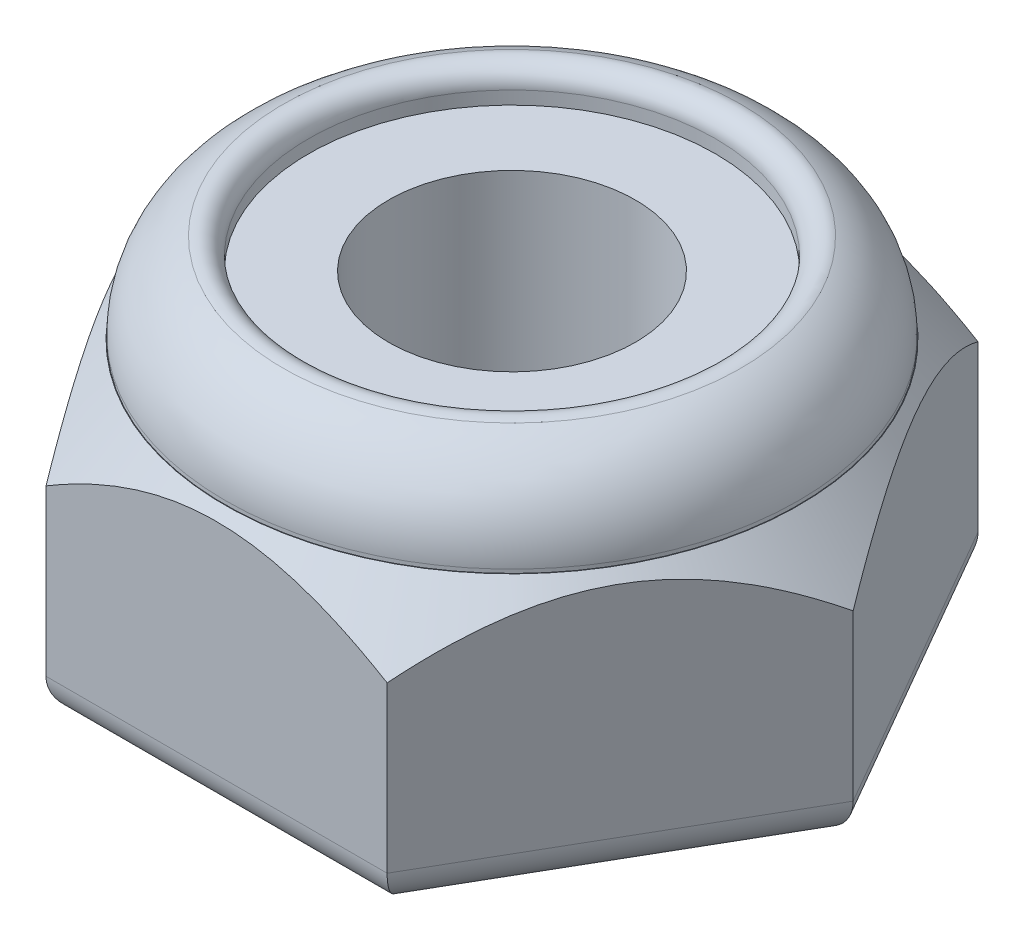
ISO-10303-21;
HEADER;
FILE_DESCRIPTION(('STEP AP214'),'2;1');
FILE_NAME('part.step','',(''),(''),'','','');
FILE_SCHEMA(('AUTOMOTIVE_DESIGN { 1 0 10303 214 1 1 1 1 }'));
ENDSEC;
DATA;
#1=APPLICATION_CONTEXT('core data for automotive mechanical design processes');
#2=APPLICATION_PROTOCOL_DEFINITION('international standard','automotive_design',2000,#1);
#3=PRODUCT_CONTEXT('',#1,'mechanical');
#4=PRODUCT('Part','Part','',(#3));
#5=PRODUCT_RELATED_PRODUCT_CATEGORY('part','',(#4));
#6=PRODUCT_DEFINITION_FORMATION('','',#4);
#7=PRODUCT_DEFINITION_CONTEXT('part definition',#1,'design');
#8=PRODUCT_DEFINITION('design','',#6,#7);
#9=PRODUCT_DEFINITION_SHAPE('','',#8);
#10=(LENGTH_UNIT() NAMED_UNIT(*) SI_UNIT(.MILLI.,.METRE.));
#11=(NAMED_UNIT(*) PLANE_ANGLE_UNIT() SI_UNIT($,.RADIAN.));
#12=(NAMED_UNIT(*) SI_UNIT($,.STERADIAN.) SOLID_ANGLE_UNIT());
#13=UNCERTAINTY_MEASURE_WITH_UNIT(LENGTH_MEASURE(1.E-05),#10,'distance_accuracy_value','');
#14=(GEOMETRIC_REPRESENTATION_CONTEXT(3) GLOBAL_UNCERTAINTY_ASSIGNED_CONTEXT((#13)) GLOBAL_UNIT_ASSIGNED_CONTEXT((#10,
#11,#12)) REPRESENTATION_CONTEXT('',''));
#15=CARTESIAN_POINT('',(0.,0.,0.));
#16=DIRECTION('',(0.,0.,1.));
#17=DIRECTION('',(1.,0.,0.));
#18=AXIS2_PLACEMENT_3D('',#15,#16,#17);
#19=CARTESIAN_POINT('',(0.,4.9784,0.));
#20=DIRECTION('',(0.,-1.,0.));
#21=DIRECTION('',(0.,0.,-1.));
#22=AXIS2_PLACEMENT_3D('',#19,#20,#21);
#23=CYLINDRICAL_SURFACE('',#22,3.937);
#24=CARTESIAN_POINT('',(0.,3.7084,0.));
#25=DIRECTION('',(0.,1.,0.));
#26=DIRECTION('',(0.,0.,1.));
#27=AXIS2_PLACEMENT_3D('',#24,#25,#26);
#28=CIRCLE('',#27,3.937);
#29=CARTESIAN_POINT('',(0.,3.7084,3.937));
#30=VERTEX_POINT('',#29);
#31=EDGE_CURVE('E172',#30,#30,#28,.T.);
#32=ORIENTED_EDGE('',*,*,#31,.F.);
#33=EDGE_LOOP('',(#32));
#34=FACE_BOUND('',#33,.T.);
#35=CARTESIAN_POINT('',(0.,3.6576,0.));
#36=DIRECTION('',(0.,-1.,0.));
#37=DIRECTION('',(0.,0.,-1.));
#38=AXIS2_PLACEMENT_3D('',#35,#36,#37);
#39=CIRCLE('',#38,3.937);
#40=CARTESIAN_POINT('',(0.,3.6576,-3.937));
#41=VERTEX_POINT('',#40);
#42=EDGE_CURVE('E18',#41,#41,#39,.F.);
#43=ORIENTED_EDGE('',*,*,#42,.T.);
#44=EDGE_LOOP('',(#43));
#45=FACE_BOUND('',#44,.T.);
#46=ADVANCED_FACE('F14',(#34,#45),#23,.T.);
#47=CARTESIAN_POINT('',(0.,3.7084,0.));
#48=DIRECTION('',(0.,1.,0.));
#49=DIRECTION('',(0.,0.,1.));
#50=AXIS2_PLACEMENT_3D('',#47,#48,#49);
#51=TOROIDAL_SURFACE('',#50,2.667,1.27);
#52=ORIENTED_EDGE('',*,*,#31,.T.);
#53=EDGE_LOOP('',(#52));
#54=FACE_BOUND('',#53,.T.);
#55=CARTESIAN_POINT('',(0.,4.88572150982644,0.));
#56=DIRECTION('',(0.,-1.,0.));
#57=DIRECTION('',(0.,0.,-1.));
#58=AXIS2_PLACEMENT_3D('',#55,#56,#57);
#59=CIRCLE('',#58,3.14325);
#60=CARTESIAN_POINT('',(0.,4.88572150982644,-3.14325));
#61=VERTEX_POINT('',#60);
#62=EDGE_CURVE('E169',#61,#61,#59,.F.);
#63=ORIENTED_EDGE('',*,*,#62,.F.);
#64=EDGE_LOOP('',(#63));
#65=FACE_BOUND('',#64,.T.);
#66=ADVANCED_FACE('F382',(#54,#65),#51,.T.);
#67=CARTESIAN_POINT('',(2.34315,3.6576,4.05845484975502));
#68=DIRECTION('',(0.,-1.,0.));
#69=DIRECTION('',(0.,0.,-1.));
#70=AXIS2_PLACEMENT_3D('',#67,#68,#69);
#71=PLANE('',#70);
#72=ORIENTED_EDGE('',*,*,#42,.F.);
#73=EDGE_LOOP('',(#72));
#74=FACE_BOUND('',#73,.T.);
#75=CARTESIAN_POINT('',(0.,3.65760000011051,0.));
#76=DIRECTION('',(0.,-1.,0.));
#77=DIRECTION('',(0.,0.,-1.));
#78=AXIS2_PLACEMENT_3D('',#75,#76,#77);
#79=CIRCLE('',#78,3.94407100938664);
#80=CARTESIAN_POINT('',(0.,3.65760000011051,-3.94407100938664));
#81=VERTEX_POINT('',#80);
#82=EDGE_CURVE('E168',#81,#81,#79,.T.);
#83=ORIENTED_EDGE('',*,*,#82,.F.);
#84=EDGE_LOOP('',(#83));
#85=FACE_BOUND('',#84,.T.);
#86=ADVANCED_FACE('F375',(#74,#85),#71,.F.);
#87=CARTESIAN_POINT('',(0.,4.65025720786115,0.));
#88=DIRECTION('',(0.,-1.,0.));
#89=DIRECTION('',(0.,0.,-1.));
#90=AXIS2_PLACEMENT_3D('',#87,#88,#89);
#91=TOROIDAL_SURFACE('',#90,3.048,0.254);
#92=CARTESIAN_POINT('',(0.,4.65025720786115,0.));
#93=DIRECTION('',(0.,1.,0.));
#94=DIRECTION('',(0.,0.,1.));
#95=AXIS2_PLACEMENT_3D('',#92,#93,#94);
#96=CIRCLE('',#95,2.794);
#97=CARTESIAN_POINT('',(0.,4.65025720786115,2.794));
#98=VERTEX_POINT('',#97);
#99=EDGE_CURVE('E103',#98,#98,#96,.F.);
#100=ORIENTED_EDGE('',*,*,#99,.T.);
#101=EDGE_LOOP('',(#100));
#102=FACE_BOUND('',#101,.T.);
#103=ORIENTED_EDGE('',*,*,#62,.T.);
#104=EDGE_LOOP('',(#103));
#105=FACE_BOUND('',#104,.T.);
#106=ADVANCED_FACE('F208',(#102,#105),#91,.T.);
#107=CARTESIAN_POINT('',(0.,2.76773860969115,0.));
#108=DIRECTION('',(0.,-1.,0.));
#109=DIRECTION('',(0.,0.,-1.));
#110=AXIS2_PLACEMENT_3D('',#107,#108,#109);
#111=CONICAL_SURFACE('',#110,4.69075337389313,0.698131700802158);
#112=CARTESIAN_POINT('',(-4.68630000001476,2.77304593398821,-5.33336085655107E-11));
#113=CARTESIAN_POINT('',(-4.65177717141793,2.81418235889091,0.0597952931149056));
#114=CARTESIAN_POINT('',(-4.61695780288956,2.85432113110728,0.120104208500933));
#115=CARTESIAN_POINT('',(-4.54666264441453,2.93230661020916,0.241858994511412));
#116=CARTESIAN_POINT('',(-4.51118655194523,2.97015222462005,0.303305389120424));
#117=CARTESIAN_POINT('',(-4.40329561885259,3.08018701500149,0.490177966909937));
#118=CARTESIAN_POINT('',(-4.32983334004397,3.14837015576205,0.617418366247689));
#119=CARTESIAN_POINT('',(-4.1797796499728,3.27092778609509,0.877318981315214));
#120=CARTESIAN_POINT('',(-4.10317943932402,3.32525984886677,1.00999443802899));
#121=CARTESIAN_POINT('',(-3.94747591651277,3.41577217646147,1.27968085045525));
#122=CARTESIAN_POINT('',(-3.86837998243724,3.45200143013375,1.4166790269463));
#123=CARTESIAN_POINT('',(-3.73746585196202,3.49372811243502,1.64342895235813));
#124=CARTESIAN_POINT('',(-3.68614686019516,3.50560413715319,1.73231605349153));
#125=CARTESIAN_POINT('',(-3.58316406708587,3.52008140702852,1.91068748346216));
#126=CARTESIAN_POINT('',(-3.53150020834088,3.5226810675312,2.00017191172355));
#127=CARTESIAN_POINT('',(-3.42855034551142,3.51847006524789,2.17848630477643));
#128=CARTESIAN_POINT('',(-3.3772638088531,3.51171021118305,2.26731719201288));
#129=CARTESIAN_POINT('',(-3.27519197708947,3.48921023555424,2.4441107906491));
#130=CARTESIAN_POINT('',(-3.22440670715057,3.4734696654174,2.53207345845939));
#131=CARTESIAN_POINT('',(-3.10963060134479,3.42817062222156,2.73087150520989));
#132=CARTESIAN_POINT('',(-3.04589899577138,3.39598542076133,2.84125788411099));
#133=CARTESIAN_POINT('',(-2.92018166739655,3.32004827846255,3.05900668424801));
#134=CARTESIAN_POINT('',(-2.85819691962206,3.27629001415058,3.16636741668776));
#135=CARTESIAN_POINT('',(-2.735889068299,3.17910361386979,3.37821082934389));
#136=CARTESIAN_POINT('',(-2.67557364738244,3.12563730731956,3.48268020285126));
#137=CARTESIAN_POINT('',(-2.55683004320588,3.01104764609313,3.68835015835892));
#138=CARTESIAN_POINT('',(-2.49840123089761,2.94992687749399,3.78955182990274));
#139=CARTESIAN_POINT('',(-2.42439626092569,2.86741854625153,3.91773219790672));
#140=CARTESIAN_POINT('',(-2.40802320106583,2.84883596648691,3.94609116945937));
#141=CARTESIAN_POINT('',(-2.3754621576302,2.81125673907332,4.00248855103733));
#142=CARTESIAN_POINT('',(-2.35927376441604,2.79226151161516,4.03052767057717));
#143=CARTESIAN_POINT('',(-2.3431499999717,2.77304593399368,4.05845484980404));
#144=B_SPLINE_CURVE_WITH_KNOTS('',3,(#112,#113,#114,#115,#116,#117,#118,#119,#120,#121,#122,
#123,#124,#125,#126,#127,#128,#129,#130,#131,#132,#133,#134,#135,#136,#137,#138,#139,#140,#141,
#142,#143),.UNSPECIFIED.,.F.,.F.,(4,2,2,2,2,2,2,2,2,2,2,2,2,2,2,4),(0.,0.241096809088565,
0.48230758945251,0.967637153847365,1.45443592242802,1.93991010956963,2.24950193433618,
2.55914664324831,2.86711700071403,3.17510274216898,3.56882084711336,3.96275452403261,
4.35827201930639,4.75365624679115,4.86660838982693,4.97921936905084),.UNSPECIFIED.);
#145=CARTESIAN_POINT('',(-4.68630000002839,2.77304593399358,0.));
#146=VERTEX_POINT('',#145);
#147=CARTESIAN_POINT('',(-2.34315000001419,2.77304593399358,4.05845484977959));
#148=VERTEX_POINT('',#147);
#149=EDGE_CURVE('E90',#146,#148,#144,.T.);
#150=ORIENTED_EDGE('',*,*,#149,.T.);
#151=CARTESIAN_POINT('',(-2.34315000005357,2.77304593398822,4.05845484974113));
#152=CARTESIAN_POINT('',(-2.27415972170409,2.81414935271336,4.05845484974989));
#153=CARTESIAN_POINT('',(-2.20457738522044,2.85425669884705,4.05845484975361));
#154=CARTESIAN_POINT('',(-2.06410193528096,2.93218331968193,4.05845484975642));
#155=CARTESIAN_POINT('',(-1.99320821641151,2.9700015013142,4.05845484975551));
#156=CARTESIAN_POINT('',(-1.77754688772429,3.07999086386455,4.05845484975401));
#157=CARTESIAN_POINT('',(-1.63068545869954,3.1481589403704,4.05845484975469));
#158=CARTESIAN_POINT('',(-1.33052752457963,3.27077676919262,4.05845484975534));
#159=CARTESIAN_POINT('',(-1.17720631609342,3.32516696804196,4.0584548497553));
#160=CARTESIAN_POINT('',(-0.865613503807779,3.41574608766059,4.05845484975473));
#161=CARTESIAN_POINT('',(-0.707359229311903,3.45199244874899,4.0584548497542));
#162=CARTESIAN_POINT('',(-0.456822143345071,3.49192146546895,4.05845484975548));
#163=CARTESIAN_POINT('',(-0.365672921156202,3.50290887295604,4.05845484975637));
#164=CARTESIAN_POINT('',(-0.183016322004482,3.51758027913678,4.05845484975366));
#165=CARTESIAN_POINT('',(-0.0915105175250817,3.52128341037061,4.05845484975007));
#166=CARTESIAN_POINT('',(0.104649468641441,3.52128177491765,4.0584548497495));
#167=CARTESIAN_POINT('',(0.209305100872023,3.51643705333648,4.05845484975354));
#168=CARTESIAN_POINT('',(0.417787181909869,3.49730239560235,4.05845484975649));
#169=CARTESIAN_POINT('',(0.521613181352877,3.48300765111694,4.05845484975541));
#170=CARTESIAN_POINT('',(0.728332544913562,3.44553375886282,4.05845484975462));
#171=CARTESIAN_POINT('',(0.831215331558566,3.42229697724238,4.05845484975491));
#172=CARTESIAN_POINT('',(1.03487580391125,3.36791830054733,4.05845484975512));
#173=CARTESIAN_POINT('',(1.13565289468809,3.33677420321768,4.05845484975504));
#174=CARTESIAN_POINT('',(1.33273383822163,3.26838741918099,4.05845484975499));
#175=CARTESIAN_POINT('',(1.42908716226035,3.23128582684656,4.05845484975501));
#176=CARTESIAN_POINT('',(1.61947291708309,3.15151071591982,4.05845484975502));
#177=CARTESIAN_POINT('',(1.71350470709807,3.10883567899407,4.05845484975502));
#178=CARTESIAN_POINT('',(1.89803195382395,3.01941532331662,4.05845484975501));
#179=CARTESIAN_POINT('',(1.98855798046432,2.97273255726059,4.05845484975502));
#180=CARTESIAN_POINT('',(2.16742834958163,2.87556944084479,4.05845484975502));
#181=CARTESIAN_POINT('',(2.25577492892455,2.82509321932285,4.05845484975502));
#182=CARTESIAN_POINT('',(2.34315000005566,2.77304593399424,4.05845484975502));
#183=B_SPLINE_CURVE_WITH_KNOTS('',3,(#151,#152,#153,#154,#155,#156,#157,#158,#159,#160,#161,
#162,#163,#164,#165,#166,#167,#168,#169,#170,#171,#172,#173,#174,#175,#176,#177,#178,#179,#180,
#181,#182),.UNSPECIFIED.,.F.,.F.,(4,2,2,2,2,2,2,2,2,2,2,2,2,2,2,4),(0.,0.24090330355952,
0.481920744736242,0.967059466968448,1.4542606837498,1.93990959177135,2.21507934695766,
2.4895253838939,2.80337599596431,3.11738642360394,3.43345557972405,3.74961286055439,
4.0591611810716,4.36879400620232,4.67425708545866,4.97939238068026),.UNSPECIFIED.);
#184=CARTESIAN_POINT('',(2.34315000001419,2.77304593399358,4.05845484977959));
#185=VERTEX_POINT('',#184);
#186=EDGE_CURVE('E82',#148,#185,#183,.T.);
#187=ORIENTED_EDGE('',*,*,#186,.T.);
#188=CARTESIAN_POINT('',(2.3431499999612,2.77304593398822,4.05845484979446));
#189=CARTESIAN_POINT('',(2.37767282857321,2.81418235889091,3.99865955663499));
#190=CARTESIAN_POINT('',(2.41249219710801,2.85432113110729,3.93835064125267));
#191=CARTESIAN_POINT('',(2.48278735558791,2.93230661020917,3.816595855245));
#192=CARTESIAN_POINT('',(2.51826344805563,2.97015222462005,3.75514946063508));
#193=CARTESIAN_POINT('',(2.62615438114571,3.08018701500149,3.56827688284408));
#194=CARTESIAN_POINT('',(2.69961665995557,3.14837015576206,3.44103648350706));
#195=CARTESIAN_POINT('',(2.84967035002766,3.2709277860951,3.18113586844006));
#196=CARTESIAN_POINT('',(2.9262705606761,3.32525984886677,3.04846041172609));
#197=CARTESIAN_POINT('',(3.08197408348711,3.41577217646148,2.77877399929969));
#198=CARTESIAN_POINT('',(3.16107001756274,3.45200143013376,2.64177582280869));
#199=CARTESIAN_POINT('',(3.291984148038,3.49372811243503,2.41502589739689));
#200=CARTESIAN_POINT('',(3.34330313980485,3.50560413715319,2.32613879626348));
#201=CARTESIAN_POINT('',(3.44628593291413,3.52008140702853,2.14776736629285));
#202=CARTESIAN_POINT('',(3.49794979165912,3.52268106753121,2.05828293803146));
#203=CARTESIAN_POINT('',(3.60089965448859,3.51847006524789,1.87996854497858));
#204=CARTESIAN_POINT('',(3.6521861911469,3.51171021118306,1.79113765774214));
#205=CARTESIAN_POINT('',(3.75425802291053,3.48921023555425,1.61434405910591));
#206=CARTESIAN_POINT('',(3.80504329284943,3.47346966541741,1.52638139129562));
#207=CARTESIAN_POINT('',(3.91981939865521,3.42817062222156,1.32758334454512));
#208=CARTESIAN_POINT('',(3.98355100422862,3.39598542076133,1.21719696564402));
#209=CARTESIAN_POINT('',(4.10926833260345,3.32004827846255,0.999448165506998));
#210=CARTESIAN_POINT('',(4.17125308037794,3.27629001415058,0.892087433067249));
#211=CARTESIAN_POINT('',(4.293560931701,3.17910361386979,0.680244020411123));
#212=CARTESIAN_POINT('',(4.35387635261756,3.12563730731956,0.575774646903748));
#213=CARTESIAN_POINT('',(4.47261995679412,3.01104764609313,0.370104691396085));
#214=CARTESIAN_POINT('',(4.53104876910239,2.94992687749399,0.268903019852268));
#215=CARTESIAN_POINT('',(4.60505373907431,2.86741854625153,0.140722651848287));
#216=CARTESIAN_POINT('',(4.62142679893417,2.84883596648691,0.112363680295636));
#217=CARTESIAN_POINT('',(4.6539878423698,2.81125673907332,0.0559662987176774));
#218=CARTESIAN_POINT('',(4.67017623558396,2.79226151161516,0.0279271791778415));
#219=CARTESIAN_POINT('',(4.6863000000283,2.77304593399368,-4.90270656680623E-11));
#220=B_SPLINE_CURVE_WITH_KNOTS('',3,(#188,#189,#190,#191,#192,#193,#194,#195,#196,#197,#198,
#199,#200,#201,#202,#203,#204,#205,#206,#207,#208,#209,#210,#211,#212,#213,#214,#215,#216,#217,
#218,#219),.UNSPECIFIED.,.F.,.F.,(4,2,2,2,2,2,2,2,2,2,2,2,2,2,2,4),(0.,0.241096809088564,
0.48230758945251,0.967637153847363,1.45443592242802,1.93991010956962,2.24950193433617,
2.5591466432483,2.86711700071402,3.17510274216897,3.56882084711336,3.9627545240326,
4.35827201930639,4.75365624679114,4.86660838982692,4.97921936905084),.UNSPECIFIED.);
#221=CARTESIAN_POINT('',(4.68630000001419,2.7730459340105,-2.45821041089123E-11));
#222=VERTEX_POINT('',#221);
#223=EDGE_CURVE('E87',#185,#222,#220,.T.);
#224=ORIENTED_EDGE('',*,*,#223,.T.);
#225=CARTESIAN_POINT('',(4.68630000001476,2.77304593398822,5.33267015141622E-11));
#226=CARTESIAN_POINT('',(4.65177717141792,2.81418235889091,-0.0597952931149122));
#227=CARTESIAN_POINT('',(4.61695780288956,2.85432113110729,-0.12010420850094));
#228=CARTESIAN_POINT('',(4.54666264441452,2.93230661020917,-0.241858994511418));
#229=CARTESIAN_POINT('',(4.51118655194522,2.97015222462005,-0.303305389120429));
#230=CARTESIAN_POINT('',(4.40329561885258,3.0801870150015,-0.490177966909942));
#231=CARTESIAN_POINT('',(4.32983334004397,3.14837015576206,-0.617418366247694));
#232=CARTESIAN_POINT('',(4.1797796499728,3.27092778609509,-0.877318981315217));
#233=CARTESIAN_POINT('',(4.10317943932402,3.32525984886677,-1.00999443802899));
#234=CARTESIAN_POINT('',(3.94747591651277,3.41577217646148,-1.27968085045525));
#235=CARTESIAN_POINT('',(3.86837998243724,3.45200143013375,-1.4166790269463));
#236=CARTESIAN_POINT('',(3.73746585196202,3.49372811243502,-1.64342895235813));
#237=CARTESIAN_POINT('',(3.68614686019516,3.50560413715319,-1.73231605349153));
#238=CARTESIAN_POINT('',(3.58316406708587,3.52008140702852,-1.91068748346216));
#239=CARTESIAN_POINT('',(3.53150020834088,3.5226810675312,-2.00017191172355));
#240=CARTESIAN_POINT('',(3.42855034551142,3.51847006524789,-2.17848630477643));
#241=CARTESIAN_POINT('',(3.3772638088531,3.51171021118306,-2.26731719201287));
#242=CARTESIAN_POINT('',(3.27519197708948,3.48921023555424,-2.4441107906491));
#243=CARTESIAN_POINT('',(3.22440670715057,3.4734696654174,-2.53207345845939));
#244=CARTESIAN_POINT('',(3.10963060134479,3.42817062222156,-2.73087150520989));
#245=CARTESIAN_POINT('',(3.04589899577138,3.39598542076133,-2.84125788411098));
#246=CARTESIAN_POINT('',(2.92018166739655,3.32004827846255,-3.05900668424801));
#247=CARTESIAN_POINT('',(2.85819691962206,3.27629001415058,-3.16636741668776));
#248=CARTESIAN_POINT('',(2.735889068299,3.17910361386979,-3.37821082934388));
#249=CARTESIAN_POINT('',(2.67557364738245,3.12563730731956,-3.48268020285126));
#250=CARTESIAN_POINT('',(2.55683004320588,3.01104764609313,-3.68835015835892));
#251=CARTESIAN_POINT('',(2.49840123089762,2.94992687749399,-3.78955182990274));
#252=CARTESIAN_POINT('',(2.42439626092569,2.86741854625153,-3.91773219790672));
#253=CARTESIAN_POINT('',(2.40802320106583,2.84883596648691,-3.94609116945937));
#254=CARTESIAN_POINT('',(2.3754621576302,2.81125673907332,-4.00248855103733));
#255=CARTESIAN_POINT('',(2.35927376441604,2.79226151161516,-4.03052767057717));
#256=CARTESIAN_POINT('',(2.3431499999717,2.77304593399368,-4.05845484980404));
#257=B_SPLINE_CURVE_WITH_KNOTS('',3,(#225,#226,#227,#228,#229,#230,#231,#232,#233,#234,#235,
#236,#237,#238,#239,#240,#241,#242,#243,#244,#245,#246,#247,#248,#249,#250,#251,#252,#253,#254,
#255,#256),.UNSPECIFIED.,.F.,.F.,(4,2,2,2,2,2,2,2,2,2,2,2,2,2,2,4),(0.,0.241096809088564,
0.482307589452508,0.96763715384736,1.45443592242801,1.93991010956962,2.24950193433616,
2.55914664324829,2.86711700071401,3.17510274216896,3.56882084711335,3.96275452403259,
4.35827201930638,4.75365624679113,4.86660838982692,4.97921936905084),.UNSPECIFIED.);
#258=CARTESIAN_POINT('',(2.34315000001419,2.77304593399358,-4.0584548497796));
#259=VERTEX_POINT('',#258);
#260=EDGE_CURVE('E124',#222,#259,#257,.T.);
#261=ORIENTED_EDGE('',*,*,#260,.T.);
#262=CARTESIAN_POINT('',(2.34315000005357,2.77304593398821,-4.05845484974114));
#263=CARTESIAN_POINT('',(2.27415972170409,2.81414935271335,-4.05845484974989));
#264=CARTESIAN_POINT('',(2.20457738522045,2.85425669884704,-4.05845484975361));
#265=CARTESIAN_POINT('',(2.06410193528096,2.93218331968193,-4.05845484975643));
#266=CARTESIAN_POINT('',(1.99320821641151,2.97000150131419,-4.05845484975552));
#267=CARTESIAN_POINT('',(1.77754688772429,3.07999086386454,-4.05845484975402));
#268=CARTESIAN_POINT('',(1.63068545869954,3.1481589403704,-4.0584548497547));
#269=CARTESIAN_POINT('',(1.33052752457963,3.27077676919261,-4.05845484975534));
#270=CARTESIAN_POINT('',(1.17720631609342,3.32516696804195,-4.0584548497553));
#271=CARTESIAN_POINT('',(0.865613503807778,3.41574608766058,-4.05845484975474));
#272=CARTESIAN_POINT('',(0.707359229311901,3.45199244874898,-4.0584548497542));
#273=CARTESIAN_POINT('',(0.456822143345069,3.49192146546895,-4.05845484975548));
#274=CARTESIAN_POINT('',(0.365672921156201,3.50290887295604,-4.05845484975637));
#275=CARTESIAN_POINT('',(0.183016322004481,3.51758027913677,-4.05845484975367));
#276=CARTESIAN_POINT('',(0.0915105175250814,3.5212834103706,-4.05845484975008));
#277=CARTESIAN_POINT('',(-0.104649468641441,3.52128177491764,-4.0584548497495));
#278=CARTESIAN_POINT('',(-0.209305100872023,3.51643705333648,-4.05845484975354));
#279=CARTESIAN_POINT('',(-0.41778718190987,3.49730239560234,-4.0584548497565));
#280=CARTESIAN_POINT('',(-0.521613181352877,3.48300765111693,-4.05845484975542));
#281=CARTESIAN_POINT('',(-0.728332544913562,3.44553375886281,-4.05845484975462));
#282=CARTESIAN_POINT('',(-0.831215331558566,3.42229697724237,-4.05845484975491));
#283=CARTESIAN_POINT('',(-1.03487580391125,3.36791830054732,-4.05845484975513));
#284=CARTESIAN_POINT('',(-1.13565289468809,3.33677420321767,-4.05845484975505));
#285=CARTESIAN_POINT('',(-1.33273383822163,3.26838741918098,-4.05845484975499));
#286=CARTESIAN_POINT('',(-1.42908716226035,3.23128582684655,-4.05845484975501));
#287=CARTESIAN_POINT('',(-1.61947291708309,3.15151071591982,-4.05845484975503));
#288=CARTESIAN_POINT('',(-1.71350470709807,3.10883567899406,-4.05845484975502));
#289=CARTESIAN_POINT('',(-1.89803195382395,3.01941532331662,-4.05845484975502));
#290=CARTESIAN_POINT('',(-1.98855798046431,2.97273255726059,-4.05845484975502));
#291=CARTESIAN_POINT('',(-2.16742834958162,2.87556944084479,-4.05845484975502));
#292=CARTESIAN_POINT('',(-2.25577492892455,2.82509321932284,-4.05845484975502));
#293=CARTESIAN_POINT('',(-2.34315000005566,2.77304593399424,-4.05845484975502));
#294=B_SPLINE_CURVE_WITH_KNOTS('',3,(#262,#263,#264,#265,#266,#267,#268,#269,#270,#271,#272,
#273,#274,#275,#276,#277,#278,#279,#280,#281,#282,#283,#284,#285,#286,#287,#288,#289,#290,#291,
#292,#293),.UNSPECIFIED.,.F.,.F.,(4,2,2,2,2,2,2,2,2,2,2,2,2,2,2,4),(0.,0.24090330355952,
0.481920744736243,0.967059466968449,1.4542606837498,1.93990959177135,2.21507934695766,
2.48952538389391,2.80337599596432,3.11738642360394,3.43345557972405,3.74961286055439,
4.0591611810716,4.36879400620232,4.67425708545866,4.97939238068026),.UNSPECIFIED.);
#295=CARTESIAN_POINT('',(-2.34315000001419,2.77304593399358,-4.0584548497796));
#296=VERTEX_POINT('',#295);
#297=EDGE_CURVE('E121',#259,#296,#294,.T.);
#298=ORIENTED_EDGE('',*,*,#297,.T.);
#299=CARTESIAN_POINT('',(-2.3431499999612,2.77304593398821,-4.05845484979447));
#300=CARTESIAN_POINT('',(-2.37767282857321,2.81418235889091,-3.99865955663499));
#301=CARTESIAN_POINT('',(-2.41249219710802,2.85432113110728,-3.93835064125268));
#302=CARTESIAN_POINT('',(-2.48278735558791,2.93230661020916,-3.81659585524501));
#303=CARTESIAN_POINT('',(-2.51826344805563,2.97015222462005,-3.75514946063508));
#304=CARTESIAN_POINT('',(-2.62615438114571,3.08018701500149,-3.56827688284409));
#305=CARTESIAN_POINT('',(-2.69961665995557,3.14837015576205,-3.44103648350706));
#306=CARTESIAN_POINT('',(-2.84967035002766,3.27092778609509,-3.18113586844007));
#307=CARTESIAN_POINT('',(-2.9262705606761,3.32525984886676,-3.0484604117261));
#308=CARTESIAN_POINT('',(-3.08197408348711,3.41577217646147,-2.7787739992997));
#309=CARTESIAN_POINT('',(-3.16107001756274,3.45200143013375,-2.6417758228087));
#310=CARTESIAN_POINT('',(-3.291984148038,3.49372811243502,-2.4150258973969));
#311=CARTESIAN_POINT('',(-3.34330313980485,3.50560413715318,-2.32613879626349));
#312=CARTESIAN_POINT('',(-3.44628593291413,3.52008140702852,-2.14776736629286));
#313=CARTESIAN_POINT('',(-3.49794979165912,3.5226810675312,-2.05828293803147));
#314=CARTESIAN_POINT('',(-3.60089965448859,3.51847006524788,-1.87996854497859));
#315=CARTESIAN_POINT('',(-3.6521861911469,3.51171021118305,-1.79113765774214));
#316=CARTESIAN_POINT('',(-3.75425802291053,3.48921023555424,-1.61434405910592));
#317=CARTESIAN_POINT('',(-3.80504329284944,3.4734696654174,-1.52638139129563));
#318=CARTESIAN_POINT('',(-3.91981939865521,3.42817062222155,-1.32758334454513));
#319=CARTESIAN_POINT('',(-3.98355100422863,3.39598542076132,-1.21719696564403));
#320=CARTESIAN_POINT('',(-4.10926833260346,3.32004827846254,-0.999448165507007));
#321=CARTESIAN_POINT('',(-4.17125308037794,3.27629001415057,-0.892087433067259));
#322=CARTESIAN_POINT('',(-4.29356093170101,3.17910361386978,-0.680244020411133));
#323=CARTESIAN_POINT('',(-4.35387635261756,3.12563730731955,-0.575774646903757));
#324=CARTESIAN_POINT('',(-4.47261995679413,3.01104764609312,-0.370104691396094));
#325=CARTESIAN_POINT('',(-4.53104876910239,2.94992687749399,-0.268903019852276));
#326=CARTESIAN_POINT('',(-4.60505373907432,2.86741854625152,-0.140722651848295));
#327=CARTESIAN_POINT('',(-4.62142679893418,2.84883596648691,-0.112363680295645));
#328=CARTESIAN_POINT('',(-4.6539878423698,2.81125673907331,-0.0559662987176856));
#329=CARTESIAN_POINT('',(-4.67017623558397,2.79226151161516,-0.0279271791778497));
#330=CARTESIAN_POINT('',(-4.68630000002831,2.77304593399367,4.90189426816293E-11));
#331=B_SPLINE_CURVE_WITH_KNOTS('',3,(#299,#300,#301,#302,#303,#304,#305,#306,#307,#308,#309,
#310,#311,#312,#313,#314,#315,#316,#317,#318,#319,#320,#321,#322,#323,#324,#325,#326,#327,#328,
#329,#330),.UNSPECIFIED.,.F.,.F.,(4,2,2,2,2,2,2,2,2,2,2,2,2,2,2,4),(0.,0.241096809088564,
0.482307589452508,0.967637153847361,1.45443592242802,1.93991010956962,2.24950193433617,
2.5591466432483,2.86711700071402,3.17510274216897,3.56882084711335,3.9627545240326,
4.35827201930639,4.75365624679114,4.86660838982692,4.97921936905084),.UNSPECIFIED.);
#332=EDGE_CURVE('E118',#296,#146,#331,.T.);
#333=ORIENTED_EDGE('',*,*,#332,.T.);
#334=EDGE_LOOP('',(#150,#187,#224,#261,#298,#333));
#335=FACE_BOUND('',#334,.T.);
#336=ORIENTED_EDGE('',*,*,#82,.T.);
#337=EDGE_LOOP('',(#336));
#338=FACE_BOUND('',#337,.T.);
#339=ADVANCED_FACE('F84',(#335,#338),#111,.T.);
#340=CARTESIAN_POINT('',(0.,4.4704,0.));
#341=DIRECTION('',(0.,1.,0.));
#342=DIRECTION('',(0.,0.,1.));
#343=AXIS2_PLACEMENT_3D('',#340,#341,#342);
#344=CYLINDRICAL_SURFACE('',#343,2.794);
#345=ORIENTED_EDGE('',*,*,#99,.F.);
#346=EDGE_LOOP('',(#345));
#347=FACE_BOUND('',#346,.T.);
#348=CARTESIAN_POINT('',(0.,4.4704,0.));
#349=DIRECTION('',(0.,1.,0.));
#350=DIRECTION('',(0.,0.,1.));
#351=AXIS2_PLACEMENT_3D('',#348,#349,#350);
#352=CIRCLE('',#351,2.794);
#353=CARTESIAN_POINT('',(0.,4.4704,2.794));
#354=VERTEX_POINT('',#353);
#355=EDGE_CURVE('E126',#354,#354,#352,.T.);
#356=ORIENTED_EDGE('',*,*,#355,.F.);
#357=EDGE_LOOP('',(#356));
#358=FACE_BOUND('',#357,.T.);
#359=ADVANCED_FACE('F207',(#347,#358),#344,.F.);
#360=CARTESIAN_POINT('',(2.34315,3.6576,4.05845484975502));
#361=DIRECTION('',(-0.866025403784439,0.,-0.499999999999999));
#362=DIRECTION('',(-0.499999999999999,0.,0.866025403784439));
#363=AXIS2_PLACEMENT_3D('',#360,#361,#362);
#364=PLANE('',#363);
#365=DIRECTION('',(-0.499999999999999,0.,0.866025403784439));
#366=VECTOR('',#365,1.);
#367=CARTESIAN_POINT('',(2.34315,0.508,4.05845484975502));
#368=LINE('',#367,#366);
#369=CARTESIAN_POINT('',(4.6863,0.508,0.));
#370=VERTEX_POINT('',#369);
#371=CARTESIAN_POINT('',(2.34315000000001,0.508,4.05845484975502));
#372=VERTEX_POINT('',#371);
#373=EDGE_CURVE('E129',#370,#372,#368,.T.);
#374=ORIENTED_EDGE('',*,*,#373,.F.);
#375=DIRECTION('',(0.,1.,0.));
#376=VECTOR('',#375,1.);
#377=CARTESIAN_POINT('',(4.6863,3.6576,0.));
#378=LINE('',#377,#376);
#379=EDGE_CURVE('E101',#370,#222,#378,.T.);
#380=ORIENTED_EDGE('',*,*,#379,.T.);
#381=ORIENTED_EDGE('',*,*,#223,.F.);
#382=DIRECTION('',(0.,1.,0.));
#383=VECTOR('',#382,1.);
#384=CARTESIAN_POINT('',(2.34315000000001,3.6576,4.05845484975502));
#385=LINE('',#384,#383);
#386=EDGE_CURVE('E94',#185,#372,#385,.F.);
#387=ORIENTED_EDGE('',*,*,#386,.T.);
#388=EDGE_LOOP('',(#374,#380,#381,#387));
#389=FACE_BOUND('',#388,.T.);
#390=ADVANCED_FACE('F98',(#389),#364,.F.);
#391=CARTESIAN_POINT('',(-2.34315,3.6576,4.05845484975501));
#392=DIRECTION('',(0.,0.,-1.));
#393=DIRECTION('',(-1.,0.,0.));
#394=AXIS2_PLACEMENT_3D('',#391,#392,#393);
#395=PLANE('',#394);
#396=DIRECTION('',(-1.,0.,0.));
#397=VECTOR('',#396,1.);
#398=CARTESIAN_POINT('',(-2.34315,0.508,4.05845484975501));
#399=LINE('',#398,#397);
#400=CARTESIAN_POINT('',(-2.34315,0.508,4.05845484975501));
#401=VERTEX_POINT('',#400);
#402=EDGE_CURVE('E108',#372,#401,#399,.T.);
#403=ORIENTED_EDGE('',*,*,#402,.F.);
#404=ORIENTED_EDGE('',*,*,#386,.F.);
#405=ORIENTED_EDGE('',*,*,#186,.F.);
#406=DIRECTION('',(0.,1.,0.));
#407=VECTOR('',#406,1.);
#408=CARTESIAN_POINT('',(-2.34315,3.6576,4.05845484975501));
#409=LINE('',#408,#407);
#410=EDGE_CURVE('E111',#148,#401,#409,.F.);
#411=ORIENTED_EDGE('',*,*,#410,.T.);
#412=EDGE_LOOP('',(#403,#404,#405,#411));
#413=FACE_BOUND('',#412,.T.);
#414=ADVANCED_FACE('F106',(#413),#395,.F.);
#415=CARTESIAN_POINT('',(-4.6863,3.6576,0.));
#416=DIRECTION('',(0.866025403784439,0.,-0.5));
#417=DIRECTION('',(-0.5,0.,-0.866025403784439));
#418=AXIS2_PLACEMENT_3D('',#415,#416,#417);
#419=PLANE('',#418);
#420=DIRECTION('',(-0.5,0.,-0.866025403784439));
#421=VECTOR('',#420,1.);
#422=CARTESIAN_POINT('',(-4.6863,0.508,0.));
#423=LINE('',#422,#421);
#424=CARTESIAN_POINT('',(-4.6863,0.508,0.));
#425=VERTEX_POINT('',#424);
#426=EDGE_CURVE('E134',#401,#425,#423,.T.);
#427=ORIENTED_EDGE('',*,*,#426,.F.);
#428=ORIENTED_EDGE('',*,*,#410,.F.);
#429=ORIENTED_EDGE('',*,*,#149,.F.);
#430=DIRECTION('',(0.,1.,0.));
#431=VECTOR('',#430,1.);
#432=CARTESIAN_POINT('',(-4.6863,3.6576,0.));
#433=LINE('',#432,#431);
#434=EDGE_CURVE('E119',#146,#425,#433,.F.);
#435=ORIENTED_EDGE('',*,*,#434,.T.);
#436=EDGE_LOOP('',(#427,#428,#429,#435));
#437=FACE_BOUND('',#436,.T.);
#438=ADVANCED_FACE('F231',(#437),#419,.F.);
#439=CARTESIAN_POINT('',(-2.34315,3.6576,-4.05845484975502));
#440=DIRECTION('',(0.866025403784438,0.,0.5));
#441=DIRECTION('',(0.5,0.,-0.866025403784438));
#442=AXIS2_PLACEMENT_3D('',#439,#440,#441);
#443=PLANE('',#442);
#444=DIRECTION('',(0.5,0.,-0.866025403784438));
#445=VECTOR('',#444,1.);
#446=CARTESIAN_POINT('',(-2.34315,0.508,-4.05845484975502));
#447=LINE('',#446,#445);
#448=CARTESIAN_POINT('',(-2.34315,0.508,-4.05845484975502));
#449=VERTEX_POINT('',#448);
#450=EDGE_CURVE('E138',#425,#449,#447,.T.);
#451=ORIENTED_EDGE('',*,*,#450,.F.);
#452=ORIENTED_EDGE('',*,*,#434,.F.);
#453=ORIENTED_EDGE('',*,*,#332,.F.);
#454=DIRECTION('',(0.,1.,0.));
#455=VECTOR('',#454,1.);
#456=CARTESIAN_POINT('',(-2.34315,3.6576,-4.05845484975502));
#457=LINE('',#456,#455);
#458=EDGE_CURVE('E122',#296,#449,#457,.F.);
#459=ORIENTED_EDGE('',*,*,#458,.T.);
#460=EDGE_LOOP('',(#451,#452,#453,#459));
#461=FACE_BOUND('',#460,.T.);
#462=ADVANCED_FACE('F234',(#461),#443,.F.);
#463=CARTESIAN_POINT('',(2.34315,3.6576,-4.05845484975502));
#464=DIRECTION('',(0.,0.,1.));
#465=DIRECTION('',(1.,0.,0.));
#466=AXIS2_PLACEMENT_3D('',#463,#464,#465);
#467=PLANE('',#466);
#468=DIRECTION('',(1.,0.,0.));
#469=VECTOR('',#468,1.);
#470=CARTESIAN_POINT('',(2.34315,0.508,-4.05845484975502));
#471=LINE('',#470,#469);
#472=CARTESIAN_POINT('',(2.34315,0.508,-4.05845484975502));
#473=VERTEX_POINT('',#472);
#474=EDGE_CURVE('E142',#449,#473,#471,.T.);
#475=ORIENTED_EDGE('',*,*,#474,.F.);
#476=ORIENTED_EDGE('',*,*,#458,.F.);
#477=ORIENTED_EDGE('',*,*,#297,.F.);
#478=DIRECTION('',(0.,1.,0.));
#479=VECTOR('',#478,1.);
#480=CARTESIAN_POINT('',(2.34315,3.6576,-4.05845484975501));
#481=LINE('',#480,#479);
#482=EDGE_CURVE('E127',#259,#473,#481,.F.);
#483=ORIENTED_EDGE('',*,*,#482,.T.);
#484=EDGE_LOOP('',(#475,#476,#477,#483));
#485=FACE_BOUND('',#484,.T.);
#486=ADVANCED_FACE('F239',(#485),#467,.F.);
#487=CARTESIAN_POINT('',(4.6863,3.6576,0.));
#488=DIRECTION('',(-0.866025403784439,0.,0.5));
#489=DIRECTION('',(0.5,0.,0.866025403784439));
#490=AXIS2_PLACEMENT_3D('',#487,#488,#489);
#491=PLANE('',#490);
#492=DIRECTION('',(0.5,0.,0.866025403784439));
#493=VECTOR('',#492,1.);
#494=CARTESIAN_POINT('',(4.6863,0.508,0.));
#495=LINE('',#494,#493);
#496=EDGE_CURVE('E144',#473,#370,#495,.T.);
#497=ORIENTED_EDGE('',*,*,#496,.F.);
#498=ORIENTED_EDGE('',*,*,#482,.F.);
#499=ORIENTED_EDGE('',*,*,#260,.F.);
#500=ORIENTED_EDGE('',*,*,#379,.F.);
#501=EDGE_LOOP('',(#497,#498,#499,#500));
#502=FACE_BOUND('',#501,.T.);
#503=ADVANCED_FACE('F200',(#502),#491,.F.);
#504=CARTESIAN_POINT('',(0.,4.4704,0.));
#505=DIRECTION('',(0.,1.,0.));
#506=DIRECTION('',(0.,0.,1.));
#507=AXIS2_PLACEMENT_3D('',#504,#505,#506);
#508=PLANE('',#507);
#509=CARTESIAN_POINT('',(0.,4.4704,0.));
#510=DIRECTION('',(0.,1.,0.));
#511=DIRECTION('',(0.,0.,1.));
#512=AXIS2_PLACEMENT_3D('',#509,#510,#511);
#513=CIRCLE('',#512,1.69545);
#514=CARTESIAN_POINT('',(0.,4.4704,1.69545));
#515=VERTEX_POINT('',#514);
#516=EDGE_CURVE('E158',#515,#515,#513,.F.);
#517=ORIENTED_EDGE('',*,*,#516,.T.);
#518=EDGE_LOOP('',(#517));
#519=FACE_BOUND('',#518,.T.);
#520=ORIENTED_EDGE('',*,*,#355,.T.);
#521=EDGE_LOOP('',(#520));
#522=FACE_BOUND('',#521,.T.);
#523=ADVANCED_FACE('F248',(#519,#522),#508,.T.);
#524=CARTESIAN_POINT('',(1.9032090948775,0.508,3.80445484975502));
#525=DIRECTION('',(-0.499999999999999,0.,0.866025403784439));
#526=DIRECTION('',(0.866025403784439,0.,0.499999999999999));
#527=AXIS2_PLACEMENT_3D('',#524,#525,#526);
#528=CYLINDRICAL_SURFACE('',#527,0.508);
#529=CARTESIAN_POINT('',(2.04985606325167,0.508,3.55045484975502));
#530=DIRECTION('',(-0.866025403784439,0.,0.5));
#531=DIRECTION('',(-0.5,0.,-0.866025403784439));
#532=AXIS2_PLACEMENT_3D('',#529,#530,#531);
#533=ELLIPSE('',#532,0.58658787349666,0.508);
#534=CARTESIAN_POINT('',(2.04985606325167,0.,3.55045484975502));
#535=VERTEX_POINT('',#534);
#536=EDGE_CURVE('E131',#535,#372,#533,.T.);
#537=ORIENTED_EDGE('',*,*,#536,.F.);
#538=DIRECTION('',(-0.499999999999999,0.,0.866025403784439));
#539=VECTOR('',#538,1.);
#540=CARTESIAN_POINT('',(4.09971212650334,0.,0.));
#541=LINE('',#540,#539);
#542=CARTESIAN_POINT('',(4.09971212650334,0.,0.));
#543=VERTEX_POINT('',#542);
#544=EDGE_CURVE('E154',#543,#535,#541,.T.);
#545=ORIENTED_EDGE('',*,*,#544,.F.);
#546=CARTESIAN_POINT('',(4.09971212650334,0.508,0.));
#547=DIRECTION('',(0.,0.,1.));
#548=DIRECTION('',(1.,0.,0.));
#549=AXIS2_PLACEMENT_3D('',#546,#547,#548);
#550=ELLIPSE('',#549,0.58658787349666,0.508);
#551=EDGE_CURVE('E147',#370,#543,#550,.F.);
#552=ORIENTED_EDGE('',*,*,#551,.F.);
#553=ORIENTED_EDGE('',*,*,#373,.T.);
#554=EDGE_LOOP('',(#537,#545,#552,#553));
#555=FACE_BOUND('',#554,.T.);
#556=ADVANCED_FACE('F274',(#555),#528,.T.);
#557=CARTESIAN_POINT('',(-2.34315,0.508,3.55045484975501));
#558=DIRECTION('',(-1.,0.,0.));
#559=DIRECTION('',(0.,0.,1.));
#560=AXIS2_PLACEMENT_3D('',#557,#558,#559);
#561=CYLINDRICAL_SURFACE('',#560,0.508);
#562=ORIENTED_EDGE('',*,*,#536,.T.);
#563=ORIENTED_EDGE('',*,*,#402,.T.);
#564=CARTESIAN_POINT('',(-2.04985606325167,0.508,3.55045484975501));
#565=DIRECTION('',(-0.866025403784439,0.,-0.5));
#566=DIRECTION('',(0.5,0.,-0.866025403784439));
#567=AXIS2_PLACEMENT_3D('',#564,#565,#566);
#568=ELLIPSE('',#567,0.58658787349666,0.508);
#569=CARTESIAN_POINT('',(-2.04985606325167,0.,3.55045484975502));
#570=VERTEX_POINT('',#569);
#571=EDGE_CURVE('E133',#570,#401,#568,.T.);
#572=ORIENTED_EDGE('',*,*,#571,.F.);
#573=DIRECTION('',(1.,0.,0.));
#574=VECTOR('',#573,1.);
#575=CARTESIAN_POINT('',(2.34315,0.,3.55045484975502));
#576=LINE('',#575,#574);
#577=EDGE_CURVE('E157',#535,#570,#576,.F.);
#578=ORIENTED_EDGE('',*,*,#577,.F.);
#579=EDGE_LOOP('',(#562,#563,#572,#578));
#580=FACE_BOUND('',#579,.T.);
#581=ADVANCED_FACE('F278',(#580),#561,.T.);
#582=CARTESIAN_POINT('',(-4.24635909487751,0.508,-0.254000000000004));
#583=DIRECTION('',(-0.5,0.,-0.866025403784439));
#584=DIRECTION('',(-0.866025403784439,0.,0.5));
#585=AXIS2_PLACEMENT_3D('',#582,#583,#584);
#586=CYLINDRICAL_SURFACE('',#585,0.508);
#587=ORIENTED_EDGE('',*,*,#571,.T.);
#588=ORIENTED_EDGE('',*,*,#426,.T.);
#589=CARTESIAN_POINT('',(-4.09971212650334,0.508,0.));
#590=DIRECTION('',(0.,0.,-1.));
#591=DIRECTION('',(1.,0.,0.));
#592=AXIS2_PLACEMENT_3D('',#589,#590,#591);
#593=ELLIPSE('',#592,0.58658787349666,0.508);
#594=CARTESIAN_POINT('',(-4.09971212650334,0.,0.));
#595=VERTEX_POINT('',#594);
#596=EDGE_CURVE('E137',#595,#425,#593,.T.);
#597=ORIENTED_EDGE('',*,*,#596,.F.);
#598=DIRECTION('',(-0.5,0.,-0.866025403784439));
#599=VECTOR('',#598,1.);
#600=CARTESIAN_POINT('',(-2.04985606325167,0.,3.55045484975501));
#601=LINE('',#600,#599);
#602=EDGE_CURVE('E161',#570,#595,#601,.T.);
#603=ORIENTED_EDGE('',*,*,#602,.F.);
#604=EDGE_LOOP('',(#587,#588,#597,#603));
#605=FACE_BOUND('',#604,.T.);
#606=ADVANCED_FACE('F281',(#605),#586,.T.);
#607=CARTESIAN_POINT('',(-1.90320909487751,0.508,-3.80445484975502));
#608=DIRECTION('',(0.5,0.,-0.866025403784438));
#609=DIRECTION('',(-0.866025403784438,0.,-0.5));
#610=AXIS2_PLACEMENT_3D('',#607,#608,#609);
#611=CYLINDRICAL_SURFACE('',#610,0.508);
#612=ORIENTED_EDGE('',*,*,#596,.T.);
#613=ORIENTED_EDGE('',*,*,#450,.T.);
#614=CARTESIAN_POINT('',(-2.04985606325167,0.508,-3.55045484975502));
#615=DIRECTION('',(0.866025403784439,0.,-0.5));
#616=DIRECTION('',(0.5,0.,0.866025403784439));
#617=AXIS2_PLACEMENT_3D('',#614,#615,#616);
#618=ELLIPSE('',#617,0.58658787349666,0.508);
#619=CARTESIAN_POINT('',(-2.04985606325167,0.,-3.55045484975502));
#620=VERTEX_POINT('',#619);
#621=EDGE_CURVE('E141',#620,#449,#618,.T.);
#622=ORIENTED_EDGE('',*,*,#621,.F.);
#623=DIRECTION('',(0.5,0.,-0.866025403784438));
#624=VECTOR('',#623,1.);
#625=CARTESIAN_POINT('',(-4.09971212650334,0.,0.));
#626=LINE('',#625,#624);
#627=EDGE_CURVE('E151',#595,#620,#626,.T.);
#628=ORIENTED_EDGE('',*,*,#627,.F.);
#629=EDGE_LOOP('',(#612,#613,#622,#628));
#630=FACE_BOUND('',#629,.T.);
#631=ADVANCED_FACE('F265',(#630),#611,.T.);
#632=CARTESIAN_POINT('',(2.34315,0.508,-3.55045484975502));
#633=DIRECTION('',(1.,0.,0.));
#634=DIRECTION('',(0.,0.,-1.));
#635=AXIS2_PLACEMENT_3D('',#632,#633,#634);
#636=CYLINDRICAL_SURFACE('',#635,0.508);
#637=ORIENTED_EDGE('',*,*,#621,.T.);
#638=ORIENTED_EDGE('',*,*,#474,.T.);
#639=CARTESIAN_POINT('',(2.04985606325167,0.508,-3.55045484975502));
#640=DIRECTION('',(0.866025403784439,0.,0.5));
#641=DIRECTION('',(-0.5,0.,0.866025403784439));
#642=AXIS2_PLACEMENT_3D('',#639,#640,#641);
#643=ELLIPSE('',#642,0.58658787349666,0.508);
#644=CARTESIAN_POINT('',(2.04985606325167,0.,-3.55045484975502));
#645=VERTEX_POINT('',#644);
#646=EDGE_CURVE('E33',#645,#473,#643,.T.);
#647=ORIENTED_EDGE('',*,*,#646,.F.);
#648=DIRECTION('',(1.,0.,0.));
#649=VECTOR('',#648,1.);
#650=CARTESIAN_POINT('',(2.34315,0.,-3.55045484975502));
#651=LINE('',#650,#649);
#652=EDGE_CURVE('E148',#620,#645,#651,.T.);
#653=ORIENTED_EDGE('',*,*,#652,.F.);
#654=EDGE_LOOP('',(#637,#638,#647,#653));
#655=FACE_BOUND('',#654,.T.);
#656=ADVANCED_FACE('F262',(#655),#636,.T.);
#657=CARTESIAN_POINT('',(4.2463590948775,0.508,0.253999999999996));
#658=DIRECTION('',(0.5,0.,0.866025403784439));
#659=DIRECTION('',(0.866025403784439,0.,-0.5));
#660=AXIS2_PLACEMENT_3D('',#657,#658,#659);
#661=CYLINDRICAL_SURFACE('',#660,0.508);
#662=ORIENTED_EDGE('',*,*,#551,.T.);
#663=DIRECTION('',(0.5,0.,0.866025403784439));
#664=VECTOR('',#663,1.);
#665=CARTESIAN_POINT('',(2.04985606325167,0.,-3.55045484975502));
#666=LINE('',#665,#664);
#667=EDGE_CURVE('E24',#645,#543,#666,.T.);
#668=ORIENTED_EDGE('',*,*,#667,.F.);
#669=ORIENTED_EDGE('',*,*,#646,.T.);
#670=ORIENTED_EDGE('',*,*,#496,.T.);
#671=EDGE_LOOP('',(#662,#668,#669,#670));
#672=FACE_BOUND('',#671,.T.);
#673=ADVANCED_FACE('F257',(#672),#661,.T.);
#674=CARTESIAN_POINT('',(0.,0.,0.));
#675=DIRECTION('',(0.,1.,0.));
#676=DIRECTION('',(0.,0.,1.));
#677=AXIS2_PLACEMENT_3D('',#674,#675,#676);
#678=CYLINDRICAL_SURFACE('',#677,1.69545);
#679=ORIENTED_EDGE('',*,*,#516,.F.);
#680=EDGE_LOOP('',(#679));
#681=FACE_BOUND('',#680,.T.);
#682=CARTESIAN_POINT('',(0.,0.,0.));
#683=DIRECTION('',(0.,1.,0.));
#684=DIRECTION('',(0.,0.,1.));
#685=AXIS2_PLACEMENT_3D('',#682,#683,#684);
#686=CIRCLE('',#685,1.69545);
#687=CARTESIAN_POINT('',(0.,0.,1.69545));
#688=VERTEX_POINT('',#687);
#689=EDGE_CURVE('E9',#688,#688,#686,.T.);
#690=ORIENTED_EDGE('',*,*,#689,.F.);
#691=EDGE_LOOP('',(#690));
#692=FACE_BOUND('',#691,.T.);
#693=ADVANCED_FACE('F252',(#681,#692),#678,.F.);
#694=CARTESIAN_POINT('',(2.34315,0.,4.05845484975502));
#695=DIRECTION('',(0.,-1.,0.));
#696=DIRECTION('',(0.,0.,-1.));
#697=AXIS2_PLACEMENT_3D('',#694,#695,#696);
#698=PLANE('',#697);
#699=ORIENTED_EDGE('',*,*,#689,.T.);
#700=EDGE_LOOP('',(#699));
#701=FACE_BOUND('',#700,.T.);
#702=ORIENTED_EDGE('',*,*,#652,.T.);
#703=ORIENTED_EDGE('',*,*,#667,.T.);
#704=ORIENTED_EDGE('',*,*,#544,.T.);
#705=ORIENTED_EDGE('',*,*,#577,.T.);
#706=ORIENTED_EDGE('',*,*,#602,.T.);
#707=ORIENTED_EDGE('',*,*,#627,.T.);
#708=EDGE_LOOP('',(#702,#703,#704,#705,#706,#707));
#709=FACE_BOUND('',#708,.T.);
#710=ADVANCED_FACE('F16',(#701,#709),#698,.T.);
#711=CLOSED_SHELL('',(#46,#66,#86,#106,#339,#359,#390,#414,#438,#462,#486,#503,#523,#556,#581,
#606,#631,#656,#673,#693,#710));
#712=MANIFOLD_SOLID_BREP('B1',#711);
#713=ADVANCED_BREP_SHAPE_REPRESENTATION('',(#18,#712),#14);
#714=SHAPE_DEFINITION_REPRESENTATION(#9,#713);
ENDSEC;
END-ISO-10303-21;
